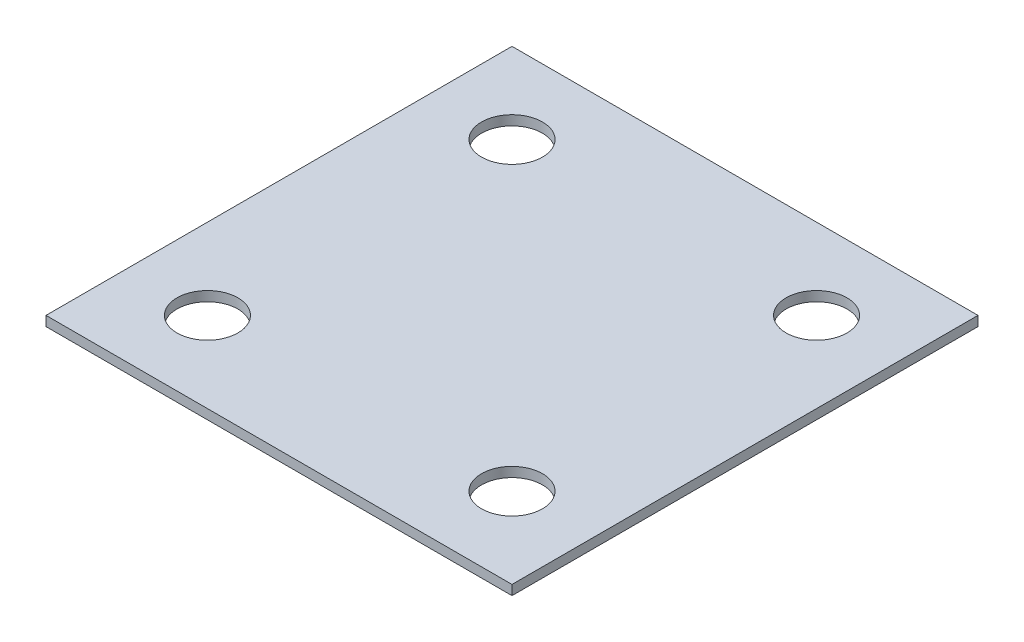
ISO-10303-21;
HEADER;
FILE_DESCRIPTION(('STEP AP214'),'2;1');
FILE_NAME('part.step','',(''),(''),'','','');
FILE_SCHEMA(('AUTOMOTIVE_DESIGN { 1 0 10303 214 1 1 1 1 }'));
ENDSEC;
DATA;
#1=APPLICATION_CONTEXT('core data for automotive mechanical design processes');
#2=APPLICATION_PROTOCOL_DEFINITION('international standard','automotive_design',2000,#1);
#3=PRODUCT_CONTEXT('',#1,'mechanical');
#4=PRODUCT('Part','Part','',(#3));
#5=PRODUCT_RELATED_PRODUCT_CATEGORY('part','',(#4));
#6=PRODUCT_DEFINITION_FORMATION('','',#4);
#7=PRODUCT_DEFINITION_CONTEXT('part definition',#1,'design');
#8=PRODUCT_DEFINITION('design','',#6,#7);
#9=PRODUCT_DEFINITION_SHAPE('','',#8);
#10=(LENGTH_UNIT() NAMED_UNIT(*) SI_UNIT(.MILLI.,.METRE.));
#11=(NAMED_UNIT(*) PLANE_ANGLE_UNIT() SI_UNIT($,.RADIAN.));
#12=(NAMED_UNIT(*) SI_UNIT($,.STERADIAN.) SOLID_ANGLE_UNIT());
#13=UNCERTAINTY_MEASURE_WITH_UNIT(LENGTH_MEASURE(1.E-05),#10,'distance_accuracy_value','');
#14=(GEOMETRIC_REPRESENTATION_CONTEXT(3) GLOBAL_UNCERTAINTY_ASSIGNED_CONTEXT((#13)) GLOBAL_UNIT_ASSIGNED_CONTEXT((#10,
#11,#12)) REPRESENTATION_CONTEXT('',''));
#15=CARTESIAN_POINT('',(0.,0.,0.));
#16=DIRECTION('',(0.,0.,1.));
#17=DIRECTION('',(1.,0.,0.));
#18=AXIS2_PLACEMENT_3D('',#15,#16,#17);
#19=CARTESIAN_POINT('',(382.5,16.,-382.5));
#20=DIRECTION('',(-1.,0.,0.));
#21=DIRECTION('',(0.,0.,1.));
#22=AXIS2_PLACEMENT_3D('',#19,#20,#21);
#23=PLANE('',#22);
#24=DIRECTION('',(0.,0.,-1.));
#25=VECTOR('',#24,1.);
#26=CARTESIAN_POINT('',(382.5,0.,-382.5));
#27=LINE('',#26,#25);
#28=CARTESIAN_POINT('',(382.5,0.,382.5));
#29=VERTEX_POINT('',#28);
#30=CARTESIAN_POINT('',(382.5,0.,-382.5));
#31=VERTEX_POINT('',#30);
#32=EDGE_CURVE('E95',#29,#31,#27,.T.);
#33=ORIENTED_EDGE('',*,*,#32,.T.);
#34=DIRECTION('',(0.,-1.,0.));
#35=VECTOR('',#34,1.);
#36=CARTESIAN_POINT('',(382.5,16.,-382.5));
#37=LINE('',#36,#35);
#38=CARTESIAN_POINT('',(382.5,16.,-382.5));
#39=VERTEX_POINT('',#38);
#40=EDGE_CURVE('E11',#39,#31,#37,.T.);
#41=ORIENTED_EDGE('',*,*,#40,.F.);
#42=DIRECTION('',(0.,0.,-1.));
#43=VECTOR('',#42,1.);
#44=CARTESIAN_POINT('',(382.5,16.,-382.5));
#45=LINE('',#44,#43);
#46=CARTESIAN_POINT('',(382.5,16.,382.5));
#47=VERTEX_POINT('',#46);
#48=EDGE_CURVE('E83',#47,#39,#45,.T.);
#49=ORIENTED_EDGE('',*,*,#48,.F.);
#50=DIRECTION('',(0.,-1.,0.));
#51=VECTOR('',#50,1.);
#52=CARTESIAN_POINT('',(382.5,16.,382.5));
#53=LINE('',#52,#51);
#54=EDGE_CURVE('E91',#47,#29,#53,.T.);
#55=ORIENTED_EDGE('',*,*,#54,.T.);
#56=EDGE_LOOP('',(#33,#41,#49,#55));
#57=FACE_BOUND('',#56,.T.);
#58=ADVANCED_FACE('F32',(#57),#23,.F.);
#59=CARTESIAN_POINT('',(-382.5,16.,-382.5));
#60=DIRECTION('',(0.,0.,1.));
#61=DIRECTION('',(1.,0.,0.));
#62=AXIS2_PLACEMENT_3D('',#59,#60,#61);
#63=PLANE('',#62);
#64=DIRECTION('',(-1.,0.,0.));
#65=VECTOR('',#64,1.);
#66=CARTESIAN_POINT('',(-382.5,0.,-382.5));
#67=LINE('',#66,#65);
#68=CARTESIAN_POINT('',(-382.5,0.,-382.5));
#69=VERTEX_POINT('',#68);
#70=EDGE_CURVE('E87',#31,#69,#67,.T.);
#71=ORIENTED_EDGE('',*,*,#70,.T.);
#72=DIRECTION('',(0.,-1.,0.));
#73=VECTOR('',#72,1.);
#74=CARTESIAN_POINT('',(-382.5,16.,-382.5));
#75=LINE('',#74,#73);
#76=CARTESIAN_POINT('',(-382.5,16.,-382.5));
#77=VERTEX_POINT('',#76);
#78=EDGE_CURVE('E40',#77,#69,#75,.T.);
#79=ORIENTED_EDGE('',*,*,#78,.F.);
#80=DIRECTION('',(-1.,0.,0.));
#81=VECTOR('',#80,1.);
#82=CARTESIAN_POINT('',(-382.5,16.,-382.5));
#83=LINE('',#82,#81);
#84=EDGE_CURVE('E78',#39,#77,#83,.T.);
#85=ORIENTED_EDGE('',*,*,#84,.F.);
#86=ORIENTED_EDGE('',*,*,#40,.T.);
#87=EDGE_LOOP('',(#71,#79,#85,#86));
#88=FACE_BOUND('',#87,.T.);
#89=ADVANCED_FACE('F86',(#88),#63,.F.);
#90=CARTESIAN_POINT('',(-382.5,16.,-382.5));
#91=DIRECTION('',(1.,0.,0.));
#92=DIRECTION('',(0.,0.,-1.));
#93=AXIS2_PLACEMENT_3D('',#90,#91,#92);
#94=PLANE('',#93);
#95=DIRECTION('',(0.,0.,1.));
#96=VECTOR('',#95,1.);
#97=CARTESIAN_POINT('',(-382.5,0.,-382.5));
#98=LINE('',#97,#96);
#99=CARTESIAN_POINT('',(-382.5,0.,382.5));
#100=VERTEX_POINT('',#99);
#101=EDGE_CURVE('E65',#69,#100,#98,.T.);
#102=ORIENTED_EDGE('',*,*,#101,.T.);
#103=DIRECTION('',(0.,-1.,0.));
#104=VECTOR('',#103,1.);
#105=CARTESIAN_POINT('',(-382.5,16.,382.5));
#106=LINE('',#105,#104);
#107=CARTESIAN_POINT('',(-382.5,16.,382.5));
#108=VERTEX_POINT('',#107);
#109=EDGE_CURVE('E88',#108,#100,#106,.T.);
#110=ORIENTED_EDGE('',*,*,#109,.F.);
#111=DIRECTION('',(0.,0.,1.));
#112=VECTOR('',#111,1.);
#113=CARTESIAN_POINT('',(-382.5,16.,-382.5));
#114=LINE('',#113,#112);
#115=EDGE_CURVE('E81',#77,#108,#114,.T.);
#116=ORIENTED_EDGE('',*,*,#115,.F.);
#117=ORIENTED_EDGE('',*,*,#78,.T.);
#118=EDGE_LOOP('',(#102,#110,#116,#117));
#119=FACE_BOUND('',#118,.T.);
#120=ADVANCED_FACE('F89',(#119),#94,.F.);
#121=CARTESIAN_POINT('',(-382.5,16.,382.5));
#122=DIRECTION('',(0.,0.,-1.));
#123=DIRECTION('',(-1.,0.,0.));
#124=AXIS2_PLACEMENT_3D('',#121,#122,#123);
#125=PLANE('',#124);
#126=DIRECTION('',(1.,0.,0.));
#127=VECTOR('',#126,1.);
#128=CARTESIAN_POINT('',(-382.5,0.,382.5));
#129=LINE('',#128,#127);
#130=EDGE_CURVE('E71',#100,#29,#129,.T.);
#131=ORIENTED_EDGE('',*,*,#130,.T.);
#132=ORIENTED_EDGE('',*,*,#54,.F.);
#133=DIRECTION('',(1.,0.,0.));
#134=VECTOR('',#133,1.);
#135=CARTESIAN_POINT('',(-382.5,16.,382.5));
#136=LINE('',#135,#134);
#137=EDGE_CURVE('E48',#108,#47,#136,.T.);
#138=ORIENTED_EDGE('',*,*,#137,.F.);
#139=ORIENTED_EDGE('',*,*,#109,.T.);
#140=EDGE_LOOP('',(#131,#132,#138,#139));
#141=FACE_BOUND('',#140,.T.);
#142=ADVANCED_FACE('F103',(#141),#125,.F.);
#143=CARTESIAN_POINT('',(0.,16.,0.));
#144=DIRECTION('',(0.,1.,0.));
#145=DIRECTION('',(0.,0.,1.));
#146=AXIS2_PLACEMENT_3D('',#143,#144,#145);
#147=PLANE('',#146);
#148=CARTESIAN_POINT('',(250.,16.,-250.));
#149=DIRECTION('',(0.,1.,0.));
#150=DIRECTION('',(0.,0.,-1.));
#151=AXIS2_PLACEMENT_3D('',#148,#149,#150);
#152=CIRCLE('',#151,50.);
#153=CARTESIAN_POINT('',(250.,16.,-300.));
#154=VERTEX_POINT('',#153);
#155=EDGE_CURVE('E125',#154,#154,#152,.T.);
#156=ORIENTED_EDGE('',*,*,#155,.F.);
#157=EDGE_LOOP('',(#156));
#158=FACE_BOUND('',#157,.T.);
#159=CARTESIAN_POINT('',(250.,16.,250.));
#160=DIRECTION('',(0.,1.,0.));
#161=DIRECTION('',(0.,0.,1.));
#162=AXIS2_PLACEMENT_3D('',#159,#160,#161);
#163=CIRCLE('',#162,50.);
#164=CARTESIAN_POINT('',(250.,16.,300.));
#165=VERTEX_POINT('',#164);
#166=EDGE_CURVE('E118',#165,#165,#163,.T.);
#167=ORIENTED_EDGE('',*,*,#166,.F.);
#168=EDGE_LOOP('',(#167));
#169=FACE_BOUND('',#168,.T.);
#170=CARTESIAN_POINT('',(-250.,16.,250.));
#171=DIRECTION('',(0.,1.,0.));
#172=DIRECTION('',(0.,0.,-1.));
#173=AXIS2_PLACEMENT_3D('',#170,#171,#172);
#174=CIRCLE('',#173,50.);
#175=CARTESIAN_POINT('',(-250.,16.,200.));
#176=VERTEX_POINT('',#175);
#177=EDGE_CURVE('E119',#176,#176,#174,.T.);
#178=ORIENTED_EDGE('',*,*,#177,.F.);
#179=EDGE_LOOP('',(#178));
#180=FACE_BOUND('',#179,.T.);
#181=CARTESIAN_POINT('',(-250.,16.,-250.));
#182=DIRECTION('',(0.,1.,0.));
#183=DIRECTION('',(0.,0.,1.));
#184=AXIS2_PLACEMENT_3D('',#181,#182,#183);
#185=CIRCLE('',#184,50.);
#186=CARTESIAN_POINT('',(-250.,16.,-200.));
#187=VERTEX_POINT('',#186);
#188=EDGE_CURVE('E111',#187,#187,#185,.T.);
#189=ORIENTED_EDGE('',*,*,#188,.F.);
#190=EDGE_LOOP('',(#189));
#191=FACE_BOUND('',#190,.T.);
#192=ORIENTED_EDGE('',*,*,#48,.T.);
#193=ORIENTED_EDGE('',*,*,#84,.T.);
#194=ORIENTED_EDGE('',*,*,#115,.T.);
#195=ORIENTED_EDGE('',*,*,#137,.T.);
#196=EDGE_LOOP('',(#192,#193,#194,#195));
#197=FACE_BOUND('',#196,.T.);
#198=ADVANCED_FACE('F79',(#158,#169,#180,#191,#197),#147,.T.);
#199=CARTESIAN_POINT('',(0.,0.,0.));
#200=DIRECTION('',(0.,1.,0.));
#201=DIRECTION('',(0.,0.,1.));
#202=AXIS2_PLACEMENT_3D('',#199,#200,#201);
#203=PLANE('',#202);
#204=CARTESIAN_POINT('',(250.,0.,-250.));
#205=DIRECTION('',(0.,1.,0.));
#206=DIRECTION('',(0.,0.,1.));
#207=AXIS2_PLACEMENT_3D('',#204,#205,#206);
#208=CIRCLE('',#207,50.);
#209=CARTESIAN_POINT('',(250.,0.,-200.));
#210=VERTEX_POINT('',#209);
#211=EDGE_CURVE('E114',#210,#210,#208,.F.);
#212=ORIENTED_EDGE('',*,*,#211,.F.);
#213=EDGE_LOOP('',(#212));
#214=FACE_BOUND('',#213,.T.);
#215=CARTESIAN_POINT('',(250.,0.,250.));
#216=DIRECTION('',(0.,1.,0.));
#217=DIRECTION('',(0.,0.,1.));
#218=AXIS2_PLACEMENT_3D('',#215,#216,#217);
#219=CIRCLE('',#218,50.);
#220=CARTESIAN_POINT('',(250.,0.,300.));
#221=VERTEX_POINT('',#220);
#222=EDGE_CURVE('E122',#221,#221,#219,.F.);
#223=ORIENTED_EDGE('',*,*,#222,.F.);
#224=EDGE_LOOP('',(#223));
#225=FACE_BOUND('',#224,.T.);
#226=CARTESIAN_POINT('',(-250.,0.,250.));
#227=DIRECTION('',(0.,1.,0.));
#228=DIRECTION('',(0.,0.,1.));
#229=AXIS2_PLACEMENT_3D('',#226,#227,#228);
#230=CIRCLE('',#229,50.);
#231=CARTESIAN_POINT('',(-250.,0.,300.));
#232=VERTEX_POINT('',#231);
#233=EDGE_CURVE('E115',#232,#232,#230,.F.);
#234=ORIENTED_EDGE('',*,*,#233,.F.);
#235=EDGE_LOOP('',(#234));
#236=FACE_BOUND('',#235,.T.);
#237=CARTESIAN_POINT('',(-250.,0.,-250.));
#238=DIRECTION('',(0.,1.,0.));
#239=DIRECTION('',(0.,0.,1.));
#240=AXIS2_PLACEMENT_3D('',#237,#238,#239);
#241=CIRCLE('',#240,50.);
#242=CARTESIAN_POINT('',(-250.,0.,-200.));
#243=VERTEX_POINT('',#242);
#244=EDGE_CURVE('E98',#243,#243,#241,.F.);
#245=ORIENTED_EDGE('',*,*,#244,.F.);
#246=EDGE_LOOP('',(#245));
#247=FACE_BOUND('',#246,.T.);
#248=ORIENTED_EDGE('',*,*,#32,.F.);
#249=ORIENTED_EDGE('',*,*,#130,.F.);
#250=ORIENTED_EDGE('',*,*,#101,.F.);
#251=ORIENTED_EDGE('',*,*,#70,.F.);
#252=EDGE_LOOP('',(#248,#249,#250,#251));
#253=FACE_BOUND('',#252,.T.);
#254=ADVANCED_FACE('F106',(#214,#225,#236,#247,#253),#203,.F.);
#255=CARTESIAN_POINT('',(-250.,-0.001000000000001,-250.));
#256=DIRECTION('',(0.,1.,0.));
#257=DIRECTION('',(0.,0.,1.));
#258=AXIS2_PLACEMENT_3D('',#255,#256,#257);
#259=CYLINDRICAL_SURFACE('',#258,50.);
#260=ORIENTED_EDGE('',*,*,#188,.T.);
#261=EDGE_LOOP('',(#260));
#262=FACE_BOUND('',#261,.T.);
#263=ORIENTED_EDGE('',*,*,#244,.T.);
#264=EDGE_LOOP('',(#263));
#265=FACE_BOUND('',#264,.T.);
#266=ADVANCED_FACE('F145',(#262,#265),#259,.F.);
#267=CARTESIAN_POINT('',(-250.,-0.001000000000001,250.));
#268=DIRECTION('',(0.,1.,0.));
#269=DIRECTION('',(0.,0.,1.));
#270=AXIS2_PLACEMENT_3D('',#267,#268,#269);
#271=CYLINDRICAL_SURFACE('',#270,50.);
#272=ORIENTED_EDGE('',*,*,#177,.T.);
#273=EDGE_LOOP('',(#272));
#274=FACE_BOUND('',#273,.T.);
#275=ORIENTED_EDGE('',*,*,#233,.T.);
#276=EDGE_LOOP('',(#275));
#277=FACE_BOUND('',#276,.T.);
#278=ADVANCED_FACE('F148',(#274,#277),#271,.F.);
#279=CARTESIAN_POINT('',(250.,-0.001000000000001,250.));
#280=DIRECTION('',(0.,1.,0.));
#281=DIRECTION('',(0.,0.,1.));
#282=AXIS2_PLACEMENT_3D('',#279,#280,#281);
#283=CYLINDRICAL_SURFACE('',#282,50.);
#284=ORIENTED_EDGE('',*,*,#166,.T.);
#285=EDGE_LOOP('',(#284));
#286=FACE_BOUND('',#285,.T.);
#287=ORIENTED_EDGE('',*,*,#222,.T.);
#288=EDGE_LOOP('',(#287));
#289=FACE_BOUND('',#288,.T.);
#290=ADVANCED_FACE('F196',(#286,#289),#283,.F.);
#291=CARTESIAN_POINT('',(250.,-0.001000000000001,-250.));
#292=DIRECTION('',(0.,1.,0.));
#293=DIRECTION('',(0.,0.,1.));
#294=AXIS2_PLACEMENT_3D('',#291,#292,#293);
#295=CYLINDRICAL_SURFACE('',#294,50.);
#296=ORIENTED_EDGE('',*,*,#155,.T.);
#297=EDGE_LOOP('',(#296));
#298=FACE_BOUND('',#297,.T.);
#299=ORIENTED_EDGE('',*,*,#211,.T.);
#300=EDGE_LOOP('',(#299));
#301=FACE_BOUND('',#300,.T.);
#302=ADVANCED_FACE('F133',(#298,#301),#295,.F.);
#303=CLOSED_SHELL('',(#58,#89,#120,#142,#198,#254,#266,#278,#290,#302));
#304=MANIFOLD_SOLID_BREP('B2',#303);
#305=ADVANCED_BREP_SHAPE_REPRESENTATION('',(#18,#304),#14);
#306=SHAPE_DEFINITION_REPRESENTATION(#9,#305);
ENDSEC;
END-ISO-10303-21;
